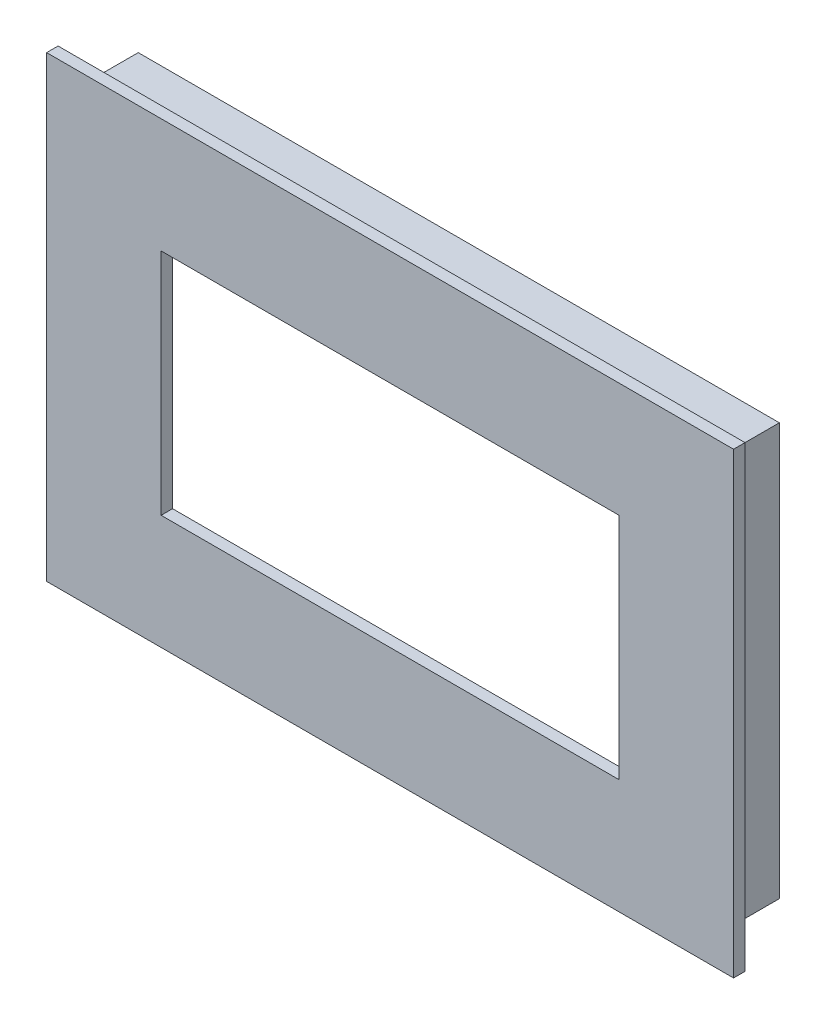
ISO-10303-21;
HEADER;
FILE_DESCRIPTION(('STEP AP214'),'2;1');
FILE_NAME('part.step','',(''),(''),'','','');
FILE_SCHEMA(('AUTOMOTIVE_DESIGN { 1 0 10303 214 1 1 1 1 }'));
ENDSEC;
DATA;
#1=APPLICATION_CONTEXT('core data for automotive mechanical design processes');
#2=APPLICATION_PROTOCOL_DEFINITION('international standard','automotive_design',2000,#1);
#3=PRODUCT_CONTEXT('',#1,'mechanical');
#4=PRODUCT('Part','Part','',(#3));
#5=PRODUCT_RELATED_PRODUCT_CATEGORY('part','',(#4));
#6=PRODUCT_DEFINITION_FORMATION('','',#4);
#7=PRODUCT_DEFINITION_CONTEXT('part definition',#1,'design');
#8=PRODUCT_DEFINITION('design','',#6,#7);
#9=PRODUCT_DEFINITION_SHAPE('','',#8);
#10=(LENGTH_UNIT() NAMED_UNIT(*) SI_UNIT(.MILLI.,.METRE.));
#11=(NAMED_UNIT(*) PLANE_ANGLE_UNIT() SI_UNIT($,.RADIAN.));
#12=(NAMED_UNIT(*) SI_UNIT($,.STERADIAN.) SOLID_ANGLE_UNIT());
#13=UNCERTAINTY_MEASURE_WITH_UNIT(LENGTH_MEASURE(1.E-05),#10,'distance_accuracy_value','');
#14=(GEOMETRIC_REPRESENTATION_CONTEXT(3) GLOBAL_UNCERTAINTY_ASSIGNED_CONTEXT((#13)) GLOBAL_UNIT_ASSIGNED_CONTEXT((#10,
#11,#12)) REPRESENTATION_CONTEXT('',''));
#15=CARTESIAN_POINT('',(0.,0.,0.));
#16=DIRECTION('',(0.,0.,1.));
#17=DIRECTION('',(1.,0.,0.));
#18=AXIS2_PLACEMENT_3D('',#15,#16,#17);
#19=CARTESIAN_POINT('',(0.,0.,0.));
#20=DIRECTION('',(0.,0.,-1.));
#21=DIRECTION('',(-1.,0.,0.));
#22=AXIS2_PLACEMENT_3D('',#19,#20,#21);
#23=PLANE('',#22);
#24=DIRECTION('',(0.,-1.,0.));
#25=VECTOR('',#24,1.);
#26=CARTESIAN_POINT('',(-28.,18.,0.));
#27=LINE('',#26,#25);
#28=CARTESIAN_POINT('',(-28.,18.,0.));
#29=VERTEX_POINT('',#28);
#30=CARTESIAN_POINT('',(-28.,-18.,0.));
#31=VERTEX_POINT('',#30);
#32=EDGE_CURVE('E293',#29,#31,#27,.T.);
#33=ORIENTED_EDGE('',*,*,#32,.F.);
#34=DIRECTION('',(-1.,0.,0.));
#35=VECTOR('',#34,1.);
#36=CARTESIAN_POINT('',(28.,18.,0.));
#37=LINE('',#36,#35);
#38=CARTESIAN_POINT('',(28.,18.,0.));
#39=VERTEX_POINT('',#38);
#40=EDGE_CURVE('E299',#39,#29,#37,.T.);
#41=ORIENTED_EDGE('',*,*,#40,.F.);
#42=DIRECTION('',(0.,1.,0.));
#43=VECTOR('',#42,1.);
#44=CARTESIAN_POINT('',(28.,18.,0.));
#45=LINE('',#44,#43);
#46=CARTESIAN_POINT('',(28.,-18.,0.));
#47=VERTEX_POINT('',#46);
#48=EDGE_CURVE('E318',#47,#39,#45,.T.);
#49=ORIENTED_EDGE('',*,*,#48,.F.);
#50=DIRECTION('',(1.,0.,0.));
#51=VECTOR('',#50,1.);
#52=CARTESIAN_POINT('',(28.,-18.,0.));
#53=LINE('',#52,#51);
#54=EDGE_CURVE('E315',#31,#47,#53,.T.);
#55=ORIENTED_EDGE('',*,*,#54,.F.);
#56=EDGE_LOOP('',(#33,#41,#49,#55));
#57=FACE_BOUND('',#56,.T.);
#58=DIRECTION('',(1.,0.,0.));
#59=VECTOR('',#58,1.);
#60=CARTESIAN_POINT('',(27.,-17.,0.));
#61=LINE('',#60,#59);
#62=CARTESIAN_POINT('',(-27.,-17.,0.));
#63=VERTEX_POINT('',#62);
#64=CARTESIAN_POINT('',(27.,-17.,0.));
#65=VERTEX_POINT('',#64);
#66=EDGE_CURVE('E253',#63,#65,#61,.T.);
#67=ORIENTED_EDGE('',*,*,#66,.T.);
#68=DIRECTION('',(0.,1.,0.));
#69=VECTOR('',#68,1.);
#70=CARTESIAN_POINT('',(27.,17.,0.));
#71=LINE('',#70,#69);
#72=CARTESIAN_POINT('',(27.,17.,0.));
#73=VERTEX_POINT('',#72);
#74=EDGE_CURVE('E247',#65,#73,#71,.T.);
#75=ORIENTED_EDGE('',*,*,#74,.T.);
#76=DIRECTION('',(-1.,0.,0.));
#77=VECTOR('',#76,1.);
#78=CARTESIAN_POINT('',(27.,17.,0.));
#79=LINE('',#78,#77);
#80=CARTESIAN_POINT('',(-27.,17.,0.));
#81=VERTEX_POINT('',#80);
#82=EDGE_CURVE('E269',#73,#81,#79,.T.);
#83=ORIENTED_EDGE('',*,*,#82,.T.);
#84=DIRECTION('',(0.,-1.,0.));
#85=VECTOR('',#84,1.);
#86=CARTESIAN_POINT('',(-27.,17.,0.));
#87=LINE('',#86,#85);
#88=EDGE_CURVE('E273',#81,#63,#87,.T.);
#89=ORIENTED_EDGE('',*,*,#88,.T.);
#90=EDGE_LOOP('',(#67,#75,#83,#89));
#91=FACE_BOUND('',#90,.T.);
#92=ADVANCED_FACE('F43',(#57,#91),#23,.T.);
#93=CARTESIAN_POINT('',(-28.,18.,5.));
#94=DIRECTION('',(1.,0.,0.));
#95=DIRECTION('',(0.,1.,0.));
#96=AXIS2_PLACEMENT_3D('',#93,#94,#95);
#97=PLANE('',#96);
#98=ORIENTED_EDGE('',*,*,#32,.T.);
#99=DIRECTION('',(0.,0.,-1.));
#100=VECTOR('',#99,1.);
#101=CARTESIAN_POINT('',(-28.,-18.,5.));
#102=LINE('',#101,#100);
#103=CARTESIAN_POINT('',(-28.,-18.,5.));
#104=VERTEX_POINT('',#103);
#105=EDGE_CURVE('E11',#104,#31,#102,.T.);
#106=ORIENTED_EDGE('',*,*,#105,.F.);
#107=DIRECTION('',(0.,-1.,0.));
#108=VECTOR('',#107,1.);
#109=CARTESIAN_POINT('',(-28.,18.,5.));
#110=LINE('',#109,#108);
#111=CARTESIAN_POINT('',(-28.,18.,5.));
#112=VERTEX_POINT('',#111);
#113=EDGE_CURVE('E294',#112,#104,#110,.T.);
#114=ORIENTED_EDGE('',*,*,#113,.F.);
#115=DIRECTION('',(0.,0.,-1.));
#116=VECTOR('',#115,1.);
#117=CARTESIAN_POINT('',(-28.,18.,5.));
#118=LINE('',#117,#116);
#119=EDGE_CURVE('E311',#112,#29,#118,.T.);
#120=ORIENTED_EDGE('',*,*,#119,.T.);
#121=EDGE_LOOP('',(#98,#106,#114,#120));
#122=FACE_BOUND('',#121,.T.);
#123=ADVANCED_FACE('F45',(#122),#97,.F.);
#124=CARTESIAN_POINT('',(28.,-18.,5.));
#125=DIRECTION('',(0.,1.,0.));
#126=DIRECTION('',(-1.,0.,0.));
#127=AXIS2_PLACEMENT_3D('',#124,#125,#126);
#128=PLANE('',#127);
#129=ORIENTED_EDGE('',*,*,#54,.T.);
#130=DIRECTION('',(0.,0.,-1.));
#131=VECTOR('',#130,1.);
#132=CARTESIAN_POINT('',(28.,-18.,5.));
#133=LINE('',#132,#131);
#134=CARTESIAN_POINT('',(28.,-18.,5.));
#135=VERTEX_POINT('',#134);
#136=EDGE_CURVE('E52',#135,#47,#133,.T.);
#137=ORIENTED_EDGE('',*,*,#136,.F.);
#138=DIRECTION('',(1.,0.,0.));
#139=VECTOR('',#138,1.);
#140=CARTESIAN_POINT('',(28.,-18.,5.));
#141=LINE('',#140,#139);
#142=EDGE_CURVE('E298',#104,#135,#141,.T.);
#143=ORIENTED_EDGE('',*,*,#142,.F.);
#144=ORIENTED_EDGE('',*,*,#105,.T.);
#145=EDGE_LOOP('',(#129,#137,#143,#144));
#146=FACE_BOUND('',#145,.T.);
#147=ADVANCED_FACE('F348',(#146),#128,.F.);
#148=CARTESIAN_POINT('',(28.,18.,5.));
#149=DIRECTION('',(-1.,0.,0.));
#150=DIRECTION('',(0.,-1.,0.));
#151=AXIS2_PLACEMENT_3D('',#148,#149,#150);
#152=PLANE('',#151);
#153=ORIENTED_EDGE('',*,*,#48,.T.);
#154=DIRECTION('',(0.,0.,-1.));
#155=VECTOR('',#154,1.);
#156=CARTESIAN_POINT('',(28.,18.,5.));
#157=LINE('',#156,#155);
#158=CARTESIAN_POINT('',(28.,18.,5.));
#159=VERTEX_POINT('',#158);
#160=EDGE_CURVE('E326',#159,#39,#157,.T.);
#161=ORIENTED_EDGE('',*,*,#160,.F.);
#162=DIRECTION('',(0.,1.,0.));
#163=VECTOR('',#162,1.);
#164=CARTESIAN_POINT('',(28.,18.,5.));
#165=LINE('',#164,#163);
#166=EDGE_CURVE('E303',#135,#159,#165,.T.);
#167=ORIENTED_EDGE('',*,*,#166,.F.);
#168=ORIENTED_EDGE('',*,*,#136,.T.);
#169=EDGE_LOOP('',(#153,#161,#167,#168));
#170=FACE_BOUND('',#169,.T.);
#171=ADVANCED_FACE('F334',(#170),#152,.F.);
#172=CARTESIAN_POINT('',(28.,18.,5.));
#173=DIRECTION('',(0.,-1.,0.));
#174=DIRECTION('',(1.,0.,0.));
#175=AXIS2_PLACEMENT_3D('',#172,#173,#174);
#176=PLANE('',#175);
#177=ORIENTED_EDGE('',*,*,#40,.T.);
#178=ORIENTED_EDGE('',*,*,#119,.F.);
#179=DIRECTION('',(-1.,0.,0.));
#180=VECTOR('',#179,1.);
#181=CARTESIAN_POINT('',(28.,18.,5.));
#182=LINE('',#181,#180);
#183=EDGE_CURVE('E307',#159,#112,#182,.T.);
#184=ORIENTED_EDGE('',*,*,#183,.F.);
#185=ORIENTED_EDGE('',*,*,#160,.T.);
#186=EDGE_LOOP('',(#177,#178,#184,#185));
#187=FACE_BOUND('',#186,.T.);
#188=ADVANCED_FACE('F342',(#187),#176,.F.);
#189=CARTESIAN_POINT('',(27.,17.,5.));
#190=DIRECTION('',(-1.,0.,0.));
#191=DIRECTION('',(0.,-1.,0.));
#192=AXIS2_PLACEMENT_3D('',#189,#190,#191);
#193=PLANE('',#192);
#194=ORIENTED_EDGE('',*,*,#74,.F.);
#195=DIRECTION('',(0.,0.,-1.));
#196=VECTOR('',#195,1.);
#197=CARTESIAN_POINT('',(27.,-17.,5.));
#198=LINE('',#197,#196);
#199=CARTESIAN_POINT('',(27.,-17.,5.));
#200=VERTEX_POINT('',#199);
#201=EDGE_CURVE('E265',#200,#65,#198,.T.);
#202=ORIENTED_EDGE('',*,*,#201,.F.);
#203=DIRECTION('',(0.,1.,0.));
#204=VECTOR('',#203,1.);
#205=CARTESIAN_POINT('',(27.,17.,5.));
#206=LINE('',#205,#204);
#207=CARTESIAN_POINT('',(27.,17.,5.));
#208=VERTEX_POINT('',#207);
#209=EDGE_CURVE('E248',#200,#208,#206,.T.);
#210=ORIENTED_EDGE('',*,*,#209,.T.);
#211=DIRECTION('',(0.,0.,-1.));
#212=VECTOR('',#211,1.);
#213=CARTESIAN_POINT('',(27.,17.,5.));
#214=LINE('',#213,#212);
#215=EDGE_CURVE('E289',#208,#73,#214,.T.);
#216=ORIENTED_EDGE('',*,*,#215,.T.);
#217=EDGE_LOOP('',(#194,#202,#210,#216));
#218=FACE_BOUND('',#217,.T.);
#219=ADVANCED_FACE('F361',(#218),#193,.T.);
#220=CARTESIAN_POINT('',(27.,17.,5.));
#221=DIRECTION('',(0.,-1.,0.));
#222=DIRECTION('',(1.,0.,0.));
#223=AXIS2_PLACEMENT_3D('',#220,#221,#222);
#224=PLANE('',#223);
#225=ORIENTED_EDGE('',*,*,#82,.F.);
#226=ORIENTED_EDGE('',*,*,#215,.F.);
#227=DIRECTION('',(-1.,0.,0.));
#228=VECTOR('',#227,1.);
#229=CARTESIAN_POINT('',(27.,17.,5.));
#230=LINE('',#229,#228);
#231=CARTESIAN_POINT('',(-27.,17.,5.));
#232=VERTEX_POINT('',#231);
#233=EDGE_CURVE('E252',#208,#232,#230,.T.);
#234=ORIENTED_EDGE('',*,*,#233,.T.);
#235=DIRECTION('',(0.,0.,-1.));
#236=VECTOR('',#235,1.);
#237=CARTESIAN_POINT('',(-27.,17.,5.));
#238=LINE('',#237,#236);
#239=EDGE_CURVE('E286',#232,#81,#238,.T.);
#240=ORIENTED_EDGE('',*,*,#239,.T.);
#241=EDGE_LOOP('',(#225,#226,#234,#240));
#242=FACE_BOUND('',#241,.T.);
#243=ADVANCED_FACE('F367',(#242),#224,.T.);
#244=CARTESIAN_POINT('',(-27.,17.,5.));
#245=DIRECTION('',(1.,0.,0.));
#246=DIRECTION('',(0.,1.,0.));
#247=AXIS2_PLACEMENT_3D('',#244,#245,#246);
#248=PLANE('',#247);
#249=ORIENTED_EDGE('',*,*,#88,.F.);
#250=ORIENTED_EDGE('',*,*,#239,.F.);
#251=DIRECTION('',(0.,-1.,0.));
#252=VECTOR('',#251,1.);
#253=CARTESIAN_POINT('',(-27.,17.,5.));
#254=LINE('',#253,#252);
#255=CARTESIAN_POINT('',(-27.,-17.,5.));
#256=VERTEX_POINT('',#255);
#257=EDGE_CURVE('E257',#232,#256,#254,.T.);
#258=ORIENTED_EDGE('',*,*,#257,.T.);
#259=DIRECTION('',(0.,0.,-1.));
#260=VECTOR('',#259,1.);
#261=CARTESIAN_POINT('',(-27.,-17.,5.));
#262=LINE('',#261,#260);
#263=EDGE_CURVE('E283',#256,#63,#262,.T.);
#264=ORIENTED_EDGE('',*,*,#263,.T.);
#265=EDGE_LOOP('',(#249,#250,#258,#264));
#266=FACE_BOUND('',#265,.T.);
#267=ADVANCED_FACE('F372',(#266),#248,.T.);
#268=CARTESIAN_POINT('',(27.,-17.,5.));
#269=DIRECTION('',(0.,1.,0.));
#270=DIRECTION('',(-1.,0.,0.));
#271=AXIS2_PLACEMENT_3D('',#268,#269,#270);
#272=PLANE('',#271);
#273=ORIENTED_EDGE('',*,*,#66,.F.);
#274=ORIENTED_EDGE('',*,*,#263,.F.);
#275=DIRECTION('',(1.,0.,0.));
#276=VECTOR('',#275,1.);
#277=CARTESIAN_POINT('',(27.,-17.,5.));
#278=LINE('',#277,#276);
#279=EDGE_CURVE('E261',#256,#200,#278,.T.);
#280=ORIENTED_EDGE('',*,*,#279,.T.);
#281=ORIENTED_EDGE('',*,*,#201,.T.);
#282=EDGE_LOOP('',(#273,#274,#280,#281));
#283=FACE_BOUND('',#282,.T.);
#284=ADVANCED_FACE('F378',(#283),#272,.T.);
#285=CARTESIAN_POINT('',(0.,0.,5.));
#286=DIRECTION('',(0.,0.,1.));
#287=DIRECTION('',(1.,0.,0.));
#288=AXIS2_PLACEMENT_3D('',#285,#286,#287);
#289=PLANE('',#288);
#290=DIRECTION('',(-1.,0.,0.));
#291=VECTOR('',#290,1.);
#292=CARTESIAN_POINT('',(0.,9.99999999999999,5.));
#293=LINE('',#292,#291);
#294=CARTESIAN_POINT('',(20.,9.99999999999999,5.));
#295=VERTEX_POINT('',#294);
#296=CARTESIAN_POINT('',(-20.,9.99999999999999,5.));
#297=VERTEX_POINT('',#296);
#298=EDGE_CURVE('E197',#295,#297,#293,.T.);
#299=ORIENTED_EDGE('',*,*,#298,.T.);
#300=DIRECTION('',(0.,-1.,0.));
#301=VECTOR('',#300,1.);
#302=CARTESIAN_POINT('',(-20.,0.,5.));
#303=LINE('',#302,#301);
#304=CARTESIAN_POINT('',(-20.,-10.,5.));
#305=VERTEX_POINT('',#304);
#306=EDGE_CURVE('E201',#297,#305,#303,.T.);
#307=ORIENTED_EDGE('',*,*,#306,.T.);
#308=DIRECTION('',(1.,0.,0.));
#309=VECTOR('',#308,1.);
#310=CARTESIAN_POINT('',(0.,-10.,5.));
#311=LINE('',#310,#309);
#312=CARTESIAN_POINT('',(20.,-10.,5.));
#313=VERTEX_POINT('',#312);
#314=EDGE_CURVE('E188',#305,#313,#311,.T.);
#315=ORIENTED_EDGE('',*,*,#314,.T.);
#316=DIRECTION('',(0.,1.,0.));
#317=VECTOR('',#316,1.);
#318=CARTESIAN_POINT('',(20.,0.,5.));
#319=LINE('',#318,#317);
#320=EDGE_CURVE('E163',#313,#295,#319,.T.);
#321=ORIENTED_EDGE('',*,*,#320,.T.);
#322=EDGE_LOOP('',(#299,#307,#315,#321));
#323=FACE_BOUND('',#322,.T.);
#324=ORIENTED_EDGE('',*,*,#209,.F.);
#325=ORIENTED_EDGE('',*,*,#279,.F.);
#326=ORIENTED_EDGE('',*,*,#257,.F.);
#327=ORIENTED_EDGE('',*,*,#233,.F.);
#328=EDGE_LOOP('',(#324,#325,#326,#327));
#329=FACE_BOUND('',#328,.T.);
#330=ADVANCED_FACE('F384',(#323,#329),#289,.F.);
#331=DIRECTION('',(1.,0.,0.));
#332=VECTOR('',#331,1.);
#333=CARTESIAN_POINT('',(-30.,-20.,5.));
#334=LINE('',#333,#332);
#335=CARTESIAN_POINT('',(-30.,-20.,5.));
#336=VERTEX_POINT('',#335);
#337=CARTESIAN_POINT('',(30.,-20.,5.));
#338=VERTEX_POINT('',#337);
#339=EDGE_CURVE('E205',#336,#338,#334,.T.);
#340=ORIENTED_EDGE('',*,*,#339,.F.);
#341=DIRECTION('',(0.,-1.,0.));
#342=VECTOR('',#341,1.);
#343=CARTESIAN_POINT('',(-30.,20.,5.));
#344=LINE('',#343,#342);
#345=CARTESIAN_POINT('',(-30.,20.,5.));
#346=VERTEX_POINT('',#345);
#347=EDGE_CURVE('E211',#346,#336,#344,.T.);
#348=ORIENTED_EDGE('',*,*,#347,.F.);
#349=DIRECTION('',(-1.,0.,0.));
#350=VECTOR('',#349,1.);
#351=CARTESIAN_POINT('',(30.,20.,5.));
#352=LINE('',#351,#350);
#353=CARTESIAN_POINT('',(30.,20.,5.));
#354=VERTEX_POINT('',#353);
#355=EDGE_CURVE('E227',#354,#346,#352,.T.);
#356=ORIENTED_EDGE('',*,*,#355,.F.);
#357=DIRECTION('',(0.,1.,0.));
#358=VECTOR('',#357,1.);
#359=CARTESIAN_POINT('',(30.,-20.,5.));
#360=LINE('',#359,#358);
#361=EDGE_CURVE('E224',#338,#354,#360,.T.);
#362=ORIENTED_EDGE('',*,*,#361,.F.);
#363=EDGE_LOOP('',(#340,#348,#356,#362));
#364=FACE_BOUND('',#363,.T.);
#365=ORIENTED_EDGE('',*,*,#183,.T.);
#366=ORIENTED_EDGE('',*,*,#113,.T.);
#367=ORIENTED_EDGE('',*,*,#142,.T.);
#368=ORIENTED_EDGE('',*,*,#166,.T.);
#369=EDGE_LOOP('',(#365,#366,#367,#368));
#370=FACE_BOUND('',#369,.T.);
#371=ADVANCED_FACE('F347',(#364,#370),#289,.F.);
#372=CARTESIAN_POINT('',(-30.,-20.,6.));
#373=DIRECTION('',(0.,1.,0.));
#374=DIRECTION('',(-1.,0.,0.));
#375=AXIS2_PLACEMENT_3D('',#372,#373,#374);
#376=PLANE('',#375);
#377=ORIENTED_EDGE('',*,*,#339,.T.);
#378=DIRECTION('',(0.,0.,-1.));
#379=VECTOR('',#378,1.);
#380=CARTESIAN_POINT('',(30.,-20.,6.));
#381=LINE('',#380,#379);
#382=CARTESIAN_POINT('',(30.,-20.,6.));
#383=VERTEX_POINT('',#382);
#384=EDGE_CURVE('E243',#383,#338,#381,.T.);
#385=ORIENTED_EDGE('',*,*,#384,.F.);
#386=DIRECTION('',(1.,0.,0.));
#387=VECTOR('',#386,1.);
#388=CARTESIAN_POINT('',(-30.,-20.,6.));
#389=LINE('',#388,#387);
#390=CARTESIAN_POINT('',(-30.,-20.,6.));
#391=VERTEX_POINT('',#390);
#392=EDGE_CURVE('E206',#391,#383,#389,.T.);
#393=ORIENTED_EDGE('',*,*,#392,.F.);
#394=DIRECTION('',(0.,0.,-1.));
#395=VECTOR('',#394,1.);
#396=CARTESIAN_POINT('',(-30.,-20.,6.));
#397=LINE('',#396,#395);
#398=EDGE_CURVE('E220',#391,#336,#397,.T.);
#399=ORIENTED_EDGE('',*,*,#398,.T.);
#400=EDGE_LOOP('',(#377,#385,#393,#399));
#401=FACE_BOUND('',#400,.T.);
#402=ADVANCED_FACE('F392',(#401),#376,.F.);
#403=CARTESIAN_POINT('',(30.,-20.,6.));
#404=DIRECTION('',(-1.,0.,0.));
#405=DIRECTION('',(0.,-1.,0.));
#406=AXIS2_PLACEMENT_3D('',#403,#404,#405);
#407=PLANE('',#406);
#408=ORIENTED_EDGE('',*,*,#361,.T.);
#409=DIRECTION('',(0.,0.,-1.));
#410=VECTOR('',#409,1.);
#411=CARTESIAN_POINT('',(30.,20.,6.));
#412=LINE('',#411,#410);
#413=CARTESIAN_POINT('',(30.,20.,6.));
#414=VERTEX_POINT('',#413);
#415=EDGE_CURVE('E239',#414,#354,#412,.T.);
#416=ORIENTED_EDGE('',*,*,#415,.F.);
#417=DIRECTION('',(0.,1.,0.));
#418=VECTOR('',#417,1.);
#419=CARTESIAN_POINT('',(30.,-20.,6.));
#420=LINE('',#419,#418);
#421=EDGE_CURVE('E210',#383,#414,#420,.T.);
#422=ORIENTED_EDGE('',*,*,#421,.F.);
#423=ORIENTED_EDGE('',*,*,#384,.T.);
#424=EDGE_LOOP('',(#408,#416,#422,#423));
#425=FACE_BOUND('',#424,.T.);
#426=ADVANCED_FACE('F405',(#425),#407,.F.);
#427=CARTESIAN_POINT('',(30.,20.,6.));
#428=DIRECTION('',(0.,-1.,0.));
#429=DIRECTION('',(1.,0.,0.));
#430=AXIS2_PLACEMENT_3D('',#427,#428,#429);
#431=PLANE('',#430);
#432=ORIENTED_EDGE('',*,*,#355,.T.);
#433=DIRECTION('',(0.,0.,-1.));
#434=VECTOR('',#433,1.);
#435=CARTESIAN_POINT('',(-30.,20.,6.));
#436=LINE('',#435,#434);
#437=CARTESIAN_POINT('',(-30.,20.,6.));
#438=VERTEX_POINT('',#437);
#439=EDGE_CURVE('E235',#438,#346,#436,.T.);
#440=ORIENTED_EDGE('',*,*,#439,.F.);
#441=DIRECTION('',(-1.,0.,0.));
#442=VECTOR('',#441,1.);
#443=CARTESIAN_POINT('',(30.,20.,6.));
#444=LINE('',#443,#442);
#445=EDGE_CURVE('E214',#414,#438,#444,.T.);
#446=ORIENTED_EDGE('',*,*,#445,.F.);
#447=ORIENTED_EDGE('',*,*,#415,.T.);
#448=EDGE_LOOP('',(#432,#440,#446,#447));
#449=FACE_BOUND('',#448,.T.);
#450=ADVANCED_FACE('F401',(#449),#431,.F.);
#451=CARTESIAN_POINT('',(-30.,20.,6.));
#452=DIRECTION('',(1.,0.,0.));
#453=DIRECTION('',(0.,1.,0.));
#454=AXIS2_PLACEMENT_3D('',#451,#452,#453);
#455=PLANE('',#454);
#456=ORIENTED_EDGE('',*,*,#347,.T.);
#457=ORIENTED_EDGE('',*,*,#398,.F.);
#458=DIRECTION('',(0.,-1.,0.));
#459=VECTOR('',#458,1.);
#460=CARTESIAN_POINT('',(-30.,20.,6.));
#461=LINE('',#460,#459);
#462=EDGE_CURVE('E217',#438,#391,#461,.T.);
#463=ORIENTED_EDGE('',*,*,#462,.F.);
#464=ORIENTED_EDGE('',*,*,#439,.T.);
#465=EDGE_LOOP('',(#456,#457,#463,#464));
#466=FACE_BOUND('',#465,.T.);
#467=ADVANCED_FACE('F398',(#466),#455,.F.);
#468=CARTESIAN_POINT('',(0.,0.,6.));
#469=DIRECTION('',(0.,0.,1.));
#470=DIRECTION('',(1.,0.,0.));
#471=AXIS2_PLACEMENT_3D('',#468,#469,#470);
#472=PLANE('',#471);
#473=DIRECTION('',(0.,-1.,0.));
#474=VECTOR('',#473,1.);
#475=CARTESIAN_POINT('',(-20.,9.99999999999999,6.));
#476=LINE('',#475,#474);
#477=CARTESIAN_POINT('',(-20.,9.99999999999999,6.));
#478=VERTEX_POINT('',#477);
#479=CARTESIAN_POINT('',(-20.,-10.,6.));
#480=VERTEX_POINT('',#479);
#481=EDGE_CURVE('E67',#478,#480,#476,.T.);
#482=ORIENTED_EDGE('',*,*,#481,.F.);
#483=DIRECTION('',(-1.,0.,0.));
#484=VECTOR('',#483,1.);
#485=CARTESIAN_POINT('',(20.,9.99999999999999,6.));
#486=LINE('',#485,#484);
#487=CARTESIAN_POINT('',(20.,9.99999999999999,6.));
#488=VERTEX_POINT('',#487);
#489=EDGE_CURVE('E178',#488,#478,#486,.T.);
#490=ORIENTED_EDGE('',*,*,#489,.F.);
#491=DIRECTION('',(0.,1.,0.));
#492=VECTOR('',#491,1.);
#493=CARTESIAN_POINT('',(20.,-10.,6.));
#494=LINE('',#493,#492);
#495=CARTESIAN_POINT('',(20.,-10.,6.));
#496=VERTEX_POINT('',#495);
#497=EDGE_CURVE('E160',#496,#488,#494,.T.);
#498=ORIENTED_EDGE('',*,*,#497,.F.);
#499=DIRECTION('',(1.,0.,0.));
#500=VECTOR('',#499,1.);
#501=CARTESIAN_POINT('',(-20.,-10.,6.));
#502=LINE('',#501,#500);
#503=EDGE_CURVE('E170',#480,#496,#502,.T.);
#504=ORIENTED_EDGE('',*,*,#503,.F.);
#505=EDGE_LOOP('',(#482,#490,#498,#504));
#506=FACE_BOUND('',#505,.T.);
#507=ORIENTED_EDGE('',*,*,#392,.T.);
#508=ORIENTED_EDGE('',*,*,#421,.T.);
#509=ORIENTED_EDGE('',*,*,#445,.T.);
#510=ORIENTED_EDGE('',*,*,#462,.T.);
#511=EDGE_LOOP('',(#507,#508,#509,#510));
#512=FACE_BOUND('',#511,.T.);
#513=ADVANCED_FACE('F175',(#506,#512),#472,.T.);
#514=CARTESIAN_POINT('',(-20.,9.99999999999999,0.));
#515=DIRECTION('',(-1.,0.,0.));
#516=DIRECTION('',(0.,-1.,0.));
#517=AXIS2_PLACEMENT_3D('',#514,#515,#516);
#518=PLANE('',#517);
#519=DIRECTION('',(0.,0.,1.));
#520=VECTOR('',#519,1.);
#521=CARTESIAN_POINT('',(-20.,9.99999999999999,0.));
#522=LINE('',#521,#520);
#523=EDGE_CURVE('E185',#297,#478,#522,.T.);
#524=ORIENTED_EDGE('',*,*,#523,.T.);
#525=ORIENTED_EDGE('',*,*,#481,.T.);
#526=DIRECTION('',(0.,0.,1.));
#527=VECTOR('',#526,1.);
#528=CARTESIAN_POINT('',(-20.,-10.,0.));
#529=LINE('',#528,#527);
#530=EDGE_CURVE('E167',#305,#480,#529,.T.);
#531=ORIENTED_EDGE('',*,*,#530,.F.);
#532=ORIENTED_EDGE('',*,*,#306,.F.);
#533=EDGE_LOOP('',(#524,#525,#531,#532));
#534=FACE_BOUND('',#533,.T.);
#535=ADVANCED_FACE('F472',(#534),#518,.F.);
#536=CARTESIAN_POINT('',(20.,9.99999999999999,0.));
#537=DIRECTION('',(0.,1.,0.));
#538=DIRECTION('',(-1.,0.,0.));
#539=AXIS2_PLACEMENT_3D('',#536,#537,#538);
#540=PLANE('',#539);
#541=DIRECTION('',(0.,0.,1.));
#542=VECTOR('',#541,1.);
#543=CARTESIAN_POINT('',(20.,9.99999999999999,0.));
#544=LINE('',#543,#542);
#545=EDGE_CURVE('E166',#295,#488,#544,.T.);
#546=ORIENTED_EDGE('',*,*,#545,.T.);
#547=ORIENTED_EDGE('',*,*,#489,.T.);
#548=ORIENTED_EDGE('',*,*,#523,.F.);
#549=ORIENTED_EDGE('',*,*,#298,.F.);
#550=EDGE_LOOP('',(#546,#547,#548,#549));
#551=FACE_BOUND('',#550,.T.);
#552=ADVANCED_FACE('F481',(#551),#540,.F.);
#553=CARTESIAN_POINT('',(20.,-10.,0.));
#554=DIRECTION('',(1.,0.,0.));
#555=DIRECTION('',(0.,1.,0.));
#556=AXIS2_PLACEMENT_3D('',#553,#554,#555);
#557=PLANE('',#556);
#558=DIRECTION('',(0.,0.,1.));
#559=VECTOR('',#558,1.);
#560=CARTESIAN_POINT('',(20.,-10.,0.));
#561=LINE('',#560,#559);
#562=EDGE_CURVE('E59',#313,#496,#561,.T.);
#563=ORIENTED_EDGE('',*,*,#562,.T.);
#564=ORIENTED_EDGE('',*,*,#497,.T.);
#565=ORIENTED_EDGE('',*,*,#545,.F.);
#566=ORIENTED_EDGE('',*,*,#320,.F.);
#567=EDGE_LOOP('',(#563,#564,#565,#566));
#568=FACE_BOUND('',#567,.T.);
#569=ADVANCED_FACE('F157',(#568),#557,.F.);
#570=CARTESIAN_POINT('',(-20.,-10.,0.));
#571=DIRECTION('',(0.,-1.,0.));
#572=DIRECTION('',(1.,0.,0.));
#573=AXIS2_PLACEMENT_3D('',#570,#571,#572);
#574=PLANE('',#573);
#575=ORIENTED_EDGE('',*,*,#530,.T.);
#576=ORIENTED_EDGE('',*,*,#503,.T.);
#577=ORIENTED_EDGE('',*,*,#562,.F.);
#578=ORIENTED_EDGE('',*,*,#314,.F.);
#579=EDGE_LOOP('',(#575,#576,#577,#578));
#580=FACE_BOUND('',#579,.T.);
#581=ADVANCED_FACE('F171',(#580),#574,.F.);
#582=CLOSED_SHELL('',(#92,#123,#147,#171,#188,#219,#243,#267,#284,#330,#371,#402,#426,#450,#467,
#513,#535,#552,#569,#581));
#583=MANIFOLD_SOLID_BREP('B2',#582);
#584=ADVANCED_BREP_SHAPE_REPRESENTATION('',(#18,#583),#14);
#585=SHAPE_DEFINITION_REPRESENTATION(#9,#584);
ENDSEC;
END-ISO-10303-21;
